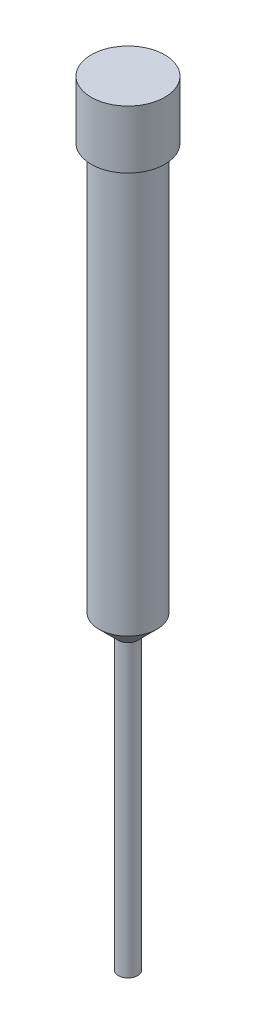
ISO-10303-21;
HEADER;
FILE_DESCRIPTION(('STEP AP214'),'2;1');
FILE_NAME('part.step','',(''),(''),'','','');
FILE_SCHEMA(('AUTOMOTIVE_DESIGN { 1 0 10303 214 1 1 1 1 }'));
ENDSEC;
DATA;
#1=APPLICATION_CONTEXT('core data for automotive mechanical design processes');
#2=APPLICATION_PROTOCOL_DEFINITION('international standard','automotive_design',2000,#1);
#3=PRODUCT_CONTEXT('',#1,'mechanical');
#4=PRODUCT('Part','Part','',(#3));
#5=PRODUCT_RELATED_PRODUCT_CATEGORY('part','',(#4));
#6=PRODUCT_DEFINITION_FORMATION('','',#4);
#7=PRODUCT_DEFINITION_CONTEXT('part definition',#1,'design');
#8=PRODUCT_DEFINITION('design','',#6,#7);
#9=PRODUCT_DEFINITION_SHAPE('','',#8);
#10=(LENGTH_UNIT() NAMED_UNIT(*) SI_UNIT(.MILLI.,.METRE.));
#11=(NAMED_UNIT(*) PLANE_ANGLE_UNIT() SI_UNIT($,.RADIAN.));
#12=(NAMED_UNIT(*) SI_UNIT($,.STERADIAN.) SOLID_ANGLE_UNIT());
#13=UNCERTAINTY_MEASURE_WITH_UNIT(LENGTH_MEASURE(1.E-05),#10,'distance_accuracy_value','');
#14=(GEOMETRIC_REPRESENTATION_CONTEXT(3) GLOBAL_UNCERTAINTY_ASSIGNED_CONTEXT((#13)) GLOBAL_UNIT_ASSIGNED_CONTEXT((#10,
#11,#12)) REPRESENTATION_CONTEXT('',''));
#15=CARTESIAN_POINT('',(0.,0.,0.));
#16=DIRECTION('',(0.,0.,1.));
#17=DIRECTION('',(1.,0.,0.));
#18=AXIS2_PLACEMENT_3D('',#15,#16,#17);
#19=CARTESIAN_POINT('',(0.,40.,0.));
#20=DIRECTION('',(0.,-1.,0.));
#21=DIRECTION('',(0.,0.,-1.));
#22=AXIS2_PLACEMENT_3D('',#19,#20,#21);
#23=CYLINDRICAL_SURFACE('',#22,1.5);
#24=CARTESIAN_POINT('',(0.,15.9999999999999,0.));
#25=DIRECTION('',(0.,1.,0.));
#26=DIRECTION('',(0.,0.,1.));
#27=AXIS2_PLACEMENT_3D('',#24,#25,#26);
#28=CIRCLE('',#27,1.5);
#29=CARTESIAN_POINT('',(0.,15.9999999999999,1.49999999999999));
#30=VERTEX_POINT('',#29);
#31=EDGE_CURVE('E49',#30,#30,#28,.T.);
#32=ORIENTED_EDGE('',*,*,#31,.T.);
#33=EDGE_LOOP('',(#32));
#34=FACE_BOUND('',#33,.T.);
#35=CARTESIAN_POINT('',(0.,37.,0.));
#36=DIRECTION('',(0.,1.,0.));
#37=DIRECTION('',(0.,0.,1.));
#38=AXIS2_PLACEMENT_3D('',#35,#36,#37);
#39=CIRCLE('',#38,1.5);
#40=CARTESIAN_POINT('',(0.,37.,1.5));
#41=VERTEX_POINT('',#40);
#42=EDGE_CURVE('E11',#41,#41,#39,.T.);
#43=ORIENTED_EDGE('',*,*,#42,.F.);
#44=EDGE_LOOP('',(#43));
#45=FACE_BOUND('',#44,.T.);
#46=ADVANCED_FACE('F41',(#34,#45),#23,.T.);
#47=CARTESIAN_POINT('',(0.,25.,0.));
#48=DIRECTION('',(0.,-1.,0.));
#49=DIRECTION('',(0.,0.,-1.));
#50=AXIS2_PLACEMENT_3D('',#47,#48,#49);
#51=CYLINDRICAL_SURFACE('',#50,0.5);
#52=CARTESIAN_POINT('',(0.,14.9999999999999,0.));
#53=DIRECTION('',(0.,1.,0.));
#54=DIRECTION('',(0.,0.,1.));
#55=AXIS2_PLACEMENT_3D('',#52,#53,#54);
#56=CIRCLE('',#55,0.5);
#57=CARTESIAN_POINT('',(0.,14.9999999999999,0.5));
#58=VERTEX_POINT('',#57);
#59=EDGE_CURVE('E53',#58,#58,#56,.F.);
#60=ORIENTED_EDGE('',*,*,#59,.T.);
#61=EDGE_LOOP('',(#60));
#62=FACE_BOUND('',#61,.T.);
#63=CARTESIAN_POINT('',(0.,0.,0.));
#64=DIRECTION('',(0.,1.,0.));
#65=DIRECTION('',(0.,0.,1.));
#66=AXIS2_PLACEMENT_3D('',#63,#64,#65);
#67=CIRCLE('',#66,0.5);
#68=CARTESIAN_POINT('',(0.,0.,0.5));
#69=VERTEX_POINT('',#68);
#70=EDGE_CURVE('E57',#69,#69,#67,.T.);
#71=ORIENTED_EDGE('',*,*,#70,.T.);
#72=EDGE_LOOP('',(#71));
#73=FACE_BOUND('',#72,.T.);
#74=ADVANCED_FACE('F84',(#62,#73),#51,.T.);
#75=CARTESIAN_POINT('',(0.,0.,0.));
#76=DIRECTION('',(0.,1.,0.));
#77=DIRECTION('',(0.,0.,1.));
#78=AXIS2_PLACEMENT_3D('',#75,#76,#77);
#79=PLANE('',#78);
#80=ORIENTED_EDGE('',*,*,#70,.F.);
#81=EDGE_LOOP('',(#80));
#82=FACE_BOUND('',#81,.T.);
#83=ADVANCED_FACE('F89',(#82),#79,.F.);
#84=CARTESIAN_POINT('',(0.,25.,0.));
#85=DIRECTION('',(0.,1.,0.));
#86=DIRECTION('',(0.,0.,1.));
#87=AXIS2_PLACEMENT_3D('',#84,#85,#86);
#88=CONICAL_SURFACE('',#87,10.5000000000002,0.785398163397453);
#89=CARTESIAN_POINT('',(0.,14.9999999999999,0.5));
#90=CARTESIAN_POINT('',(0.,15.0104166666666,0.510416666666667));
#91=CARTESIAN_POINT('',(0.,15.0208333333333,0.520833333333334));
#92=CARTESIAN_POINT('',(0.,15.0416666666666,0.541666666666667));
#93=CARTESIAN_POINT('',(0.,15.0520833333333,0.552083333333333));
#94=CARTESIAN_POINT('',(0.,15.0729166666666,0.572916666666665));
#95=CARTESIAN_POINT('',(0.,15.0833333333333,0.583333333333332));
#96=CARTESIAN_POINT('',(0.,15.1041666666666,0.604166666666666));
#97=CARTESIAN_POINT('',(0.,15.1145833333333,0.614583333333333));
#98=CARTESIAN_POINT('',(0.,15.1354166666666,0.635416666666667));
#99=CARTESIAN_POINT('',(0.,15.1458333333333,0.645833333333333));
#100=CARTESIAN_POINT('',(0.,15.1666666666666,0.666666666666665));
#101=CARTESIAN_POINT('',(0.,15.1770833333333,0.677083333333332));
#102=CARTESIAN_POINT('',(0.,15.1979166666666,0.697916666666666));
#103=CARTESIAN_POINT('',(0.,15.2083333333333,0.708333333333332));
#104=CARTESIAN_POINT('',(0.,15.2291666666666,0.729166666666666));
#105=CARTESIAN_POINT('',(0.,15.2395833333333,0.739583333333332));
#106=CARTESIAN_POINT('',(0.,15.2604166666666,0.760416666666666));
#107=CARTESIAN_POINT('',(0.,15.2708333333333,0.770833333333332));
#108=CARTESIAN_POINT('',(0.,15.2916666666666,0.791666666666666));
#109=CARTESIAN_POINT('',(0.,15.3020833333333,0.802083333333332));
#110=CARTESIAN_POINT('',(0.,15.3229166666666,0.822916666666666));
#111=CARTESIAN_POINT('',(0.,15.3333333333333,0.833333333333332));
#112=CARTESIAN_POINT('',(0.,15.3541666666666,0.854166666666665));
#113=CARTESIAN_POINT('',(0.,15.3645833333333,0.864583333333331));
#114=CARTESIAN_POINT('',(0.,15.3854166666666,0.885416666666664));
#115=CARTESIAN_POINT('',(0.,15.3958333333333,0.895833333333331));
#116=CARTESIAN_POINT('',(0.,15.4166666666666,0.916666666666664));
#117=CARTESIAN_POINT('',(0.,15.4270833333333,0.927083333333331));
#118=CARTESIAN_POINT('',(0.,15.4479166666666,0.947916666666664));
#119=CARTESIAN_POINT('',(0.,15.4583333333333,0.958333333333331));
#120=CARTESIAN_POINT('',(0.,15.4791666666666,0.979166666666664));
#121=CARTESIAN_POINT('',(0.,15.4895833333333,0.989583333333331));
#122=CARTESIAN_POINT('',(0.,15.5104166666666,1.01041666666666));
#123=CARTESIAN_POINT('',(0.,15.5208333333333,1.02083333333333));
#124=CARTESIAN_POINT('',(0.,15.5416666666666,1.04166666666666));
#125=CARTESIAN_POINT('',(0.,15.5520833333333,1.05208333333333));
#126=CARTESIAN_POINT('',(0.,15.5729166666666,1.07291666666666));
#127=CARTESIAN_POINT('',(0.,15.5833333333333,1.08333333333333));
#128=CARTESIAN_POINT('',(0.,15.6041666666666,1.10416666666666));
#129=CARTESIAN_POINT('',(0.,15.6145833333333,1.11458333333333));
#130=CARTESIAN_POINT('',(0.,15.6354166666666,1.13541666666666));
#131=CARTESIAN_POINT('',(0.,15.6458333333333,1.14583333333333));
#132=CARTESIAN_POINT('',(0.,15.6666666666666,1.16666666666666));
#133=CARTESIAN_POINT('',(0.,15.6770833333333,1.17708333333333));
#134=CARTESIAN_POINT('',(0.,15.6979166666666,1.19791666666666));
#135=CARTESIAN_POINT('',(0.,15.7083333333333,1.20833333333333));
#136=CARTESIAN_POINT('',(0.,15.7291666666666,1.22916666666666));
#137=CARTESIAN_POINT('',(0.,15.7395833333333,1.23958333333333));
#138=CARTESIAN_POINT('',(0.,15.7604166666666,1.26041666666666));
#139=CARTESIAN_POINT('',(0.,15.7708333333333,1.27083333333333));
#140=CARTESIAN_POINT('',(0.,15.7916666666666,1.29166666666666));
#141=CARTESIAN_POINT('',(0.,15.8020833333333,1.30208333333333));
#142=CARTESIAN_POINT('',(0.,15.8229166666666,1.32291666666666));
#143=CARTESIAN_POINT('',(0.,15.8333333333333,1.33333333333333));
#144=CARTESIAN_POINT('',(0.,15.8541666666666,1.35416666666666));
#145=CARTESIAN_POINT('',(0.,15.8645833333333,1.36458333333333));
#146=CARTESIAN_POINT('',(0.,15.8854166666666,1.38541666666666));
#147=CARTESIAN_POINT('',(0.,15.8958333333332,1.39583333333333));
#148=CARTESIAN_POINT('',(0.,15.9166666666666,1.41666666666666));
#149=CARTESIAN_POINT('',(0.,15.9270833333332,1.42708333333333));
#150=CARTESIAN_POINT('',(0.,15.9479166666666,1.44791666666666));
#151=CARTESIAN_POINT('',(0.,15.9583333333332,1.45833333333333));
#152=CARTESIAN_POINT('',(0.,15.9791666666666,1.47916666666666));
#153=CARTESIAN_POINT('',(0.,15.9895833333332,1.48958333333333));
#154=CARTESIAN_POINT('',(0.,15.9999999999999,1.49999999999999));
#155=B_SPLINE_CURVE_WITH_KNOTS('',3,(#89,#90,#91,#92,#93,#94,#95,#96,#97,#98,#99,#100,#101,#102,
#103,#104,#105,#106,#107,#108,#109,#110,#111,#112,#113,#114,#115,#116,#117,#118,#119,#120,#121,
#122,#123,#124,#125,#126,#127,#128,#129,#130,#131,#132,#133,#134,#135,#136,#137,#138,#139,#140,
#141,#142,#143,#144,#145,#146,#147,#148,#149,#150,#151,#152,#153,#154),.UNSPECIFIED.,.F.,.F.,(4,
2,2,2,2,2,2,2,2,2,2,2,2,2,2,2,2,2,2,2,2,2,2,2,2,2,2,2,2,2,2,2,4),(0.,0.0441941738241593,
0.0883883476483161,0.132582521472475,0.176776695296636,0.220970869120793,0.265165042944952,
0.309359216769111,0.35355339059327,0.397747564417428,0.441941738241588,0.486135912065747,
0.530330085889904,0.574524259714063,0.618718433538222,0.662912607362381,0.70710678118654,
0.751300955010699,0.795495128834856,0.839689302659015,0.883883476483176,0.928077650307334,
0.97227182413149,1.01646599795565,1.06066017177981,1.10485434560397,1.14904851942813,
1.19324269325229,1.23743686707644,1.2816310409006,1.32582521472476,1.37001938854892,
1.41421356237308),.UNSPECIFIED.);
#156=EDGE_CURVE('BSEAM44',#58,#30,#155,.T.);
#157=ORIENTED_EDGE('',*,*,#59,.F.);
#158=ORIENTED_EDGE('',*,*,#31,.F.);
#159=ORIENTED_EDGE('',*,*,#156,.T.);
#160=ORIENTED_EDGE('',*,*,#156,.F.);
#161=EDGE_LOOP('',(#157,#159,#158,#160));
#162=FACE_BOUND('',#161,.T.);
#163=ADVANCED_FACE('F44',(#162),#88,.T.);
#164=CARTESIAN_POINT('',(0.,37.,0.));
#165=DIRECTION('',(0.,1.,0.));
#166=DIRECTION('',(0.,0.,1.));
#167=AXIS2_PLACEMENT_3D('',#164,#165,#166);
#168=CYLINDRICAL_SURFACE('',#167,1.90067298343911);
#169=CARTESIAN_POINT('',(0.,37.,0.));
#170=DIRECTION('',(0.,1.,0.));
#171=DIRECTION('',(0.,0.,1.));
#172=AXIS2_PLACEMENT_3D('',#169,#170,#171);
#173=CIRCLE('',#172,1.90067298343911);
#174=CARTESIAN_POINT('',(0.,37.,1.90067298343911));
#175=VERTEX_POINT('',#174);
#176=EDGE_CURVE('E62',#175,#175,#173,.T.);
#177=ORIENTED_EDGE('',*,*,#176,.T.);
#178=EDGE_LOOP('',(#177));
#179=FACE_BOUND('',#178,.T.);
#180=CARTESIAN_POINT('',(0.,40.,0.));
#181=DIRECTION('',(0.,1.,0.));
#182=DIRECTION('',(0.,0.,1.));
#183=AXIS2_PLACEMENT_3D('',#180,#181,#182);
#184=CIRCLE('',#183,1.90067298343911);
#185=CARTESIAN_POINT('',(0.,40.,1.90067298343911));
#186=VERTEX_POINT('',#185);
#187=EDGE_CURVE('E63',#186,#186,#184,.T.);
#188=ORIENTED_EDGE('',*,*,#187,.F.);
#189=EDGE_LOOP('',(#188));
#190=FACE_BOUND('',#189,.T.);
#191=ADVANCED_FACE('F69',(#179,#190),#168,.T.);
#192=CARTESIAN_POINT('',(0.,37.,0.));
#193=DIRECTION('',(0.,1.,0.));
#194=DIRECTION('',(0.,0.,1.));
#195=AXIS2_PLACEMENT_3D('',#192,#193,#194);
#196=PLANE('',#195);
#197=ORIENTED_EDGE('',*,*,#42,.T.);
#198=EDGE_LOOP('',(#197));
#199=FACE_BOUND('',#198,.T.);
#200=ORIENTED_EDGE('',*,*,#176,.F.);
#201=EDGE_LOOP('',(#200));
#202=FACE_BOUND('',#201,.T.);
#203=ADVANCED_FACE('F72',(#199,#202),#196,.F.);
#204=CARTESIAN_POINT('',(0.,40.,0.));
#205=DIRECTION('',(0.,1.,0.));
#206=DIRECTION('',(0.,0.,1.));
#207=AXIS2_PLACEMENT_3D('',#204,#205,#206);
#208=PLANE('',#207);
#209=ORIENTED_EDGE('',*,*,#187,.T.);
#210=EDGE_LOOP('',(#209));
#211=FACE_BOUND('',#210,.T.);
#212=ADVANCED_FACE('F74',(#211),#208,.T.);
#213=CLOSED_SHELL('',(#46,#74,#83,#163,#191,#203,#212));
#214=MANIFOLD_SOLID_BREP('B2',#213);
#215=ADVANCED_BREP_SHAPE_REPRESENTATION('',(#18,#214),#14);
#216=SHAPE_DEFINITION_REPRESENTATION(#9,#215);
ENDSEC;
END-ISO-10303-21;
